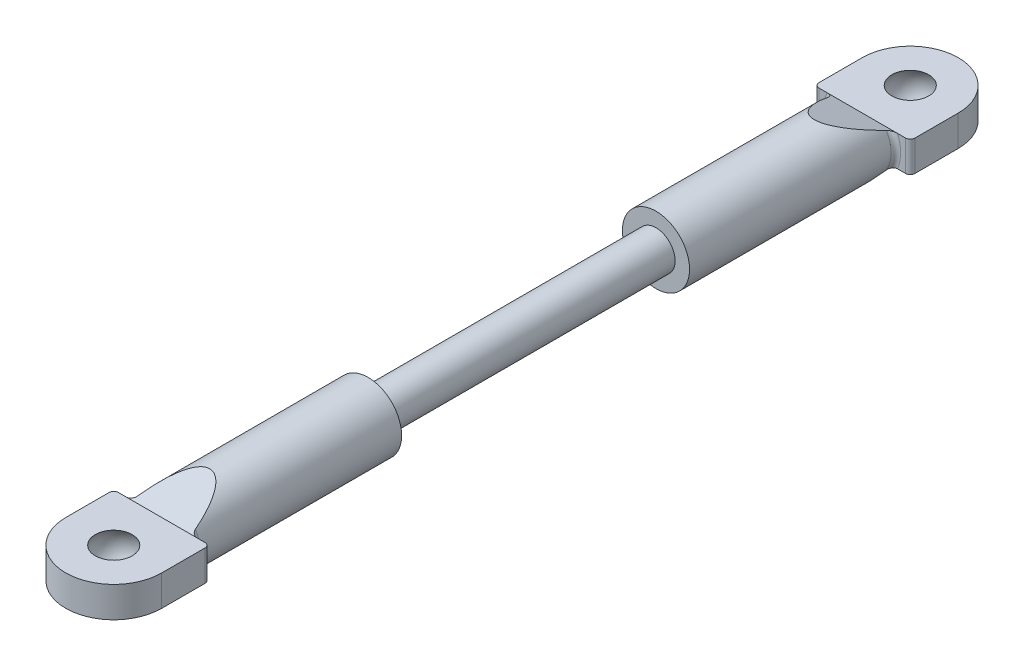
ISO-10303-21;
HEADER;
FILE_DESCRIPTION(('STEP AP214'),'2;1');
FILE_NAME('part.step','',(''),(''),'','','');
FILE_SCHEMA(('AUTOMOTIVE_DESIGN { 1 0 10303 214 1 1 1 1 }'));
ENDSEC;
DATA;
#1=APPLICATION_CONTEXT('core data for automotive mechanical design processes');
#2=APPLICATION_PROTOCOL_DEFINITION('international standard','automotive_design',2000,#1);
#3=PRODUCT_CONTEXT('',#1,'mechanical');
#4=PRODUCT('Part','Part','',(#3));
#5=PRODUCT_RELATED_PRODUCT_CATEGORY('part','',(#4));
#6=PRODUCT_DEFINITION_FORMATION('','',#4);
#7=PRODUCT_DEFINITION_CONTEXT('part definition',#1,'design');
#8=PRODUCT_DEFINITION('design','',#6,#7);
#9=PRODUCT_DEFINITION_SHAPE('','',#8);
#10=(LENGTH_UNIT() NAMED_UNIT(*) SI_UNIT(.MILLI.,.METRE.));
#11=(NAMED_UNIT(*) PLANE_ANGLE_UNIT() SI_UNIT($,.RADIAN.));
#12=(NAMED_UNIT(*) SI_UNIT($,.STERADIAN.) SOLID_ANGLE_UNIT());
#13=UNCERTAINTY_MEASURE_WITH_UNIT(LENGTH_MEASURE(1.E-05),#10,'distance_accuracy_value','');
#14=(GEOMETRIC_REPRESENTATION_CONTEXT(3) GLOBAL_UNCERTAINTY_ASSIGNED_CONTEXT((#13)) GLOBAL_UNIT_ASSIGNED_CONTEXT((#10,
#11,#12)) REPRESENTATION_CONTEXT('',''));
#15=CARTESIAN_POINT('',(0.,0.,0.));
#16=DIRECTION('',(0.,0.,1.));
#17=DIRECTION('',(1.,0.,0.));
#18=AXIS2_PLACEMENT_3D('',#15,#16,#17);
#19=CARTESIAN_POINT('',(0.,0.,-36.5));
#20=DIRECTION('',(0.,0.,1.));
#21=DIRECTION('',(1.,0.,0.));
#22=AXIS2_PLACEMENT_3D('',#19,#20,#21);
#23=CYLINDRICAL_SURFACE('',#22,3.5);
#24=CARTESIAN_POINT('',(0.,0.,-15.));
#25=DIRECTION('',(0.,0.,1.));
#26=DIRECTION('',(1.,0.,0.));
#27=AXIS2_PLACEMENT_3D('',#24,#25,#26);
#28=CIRCLE('',#27,3.5);
#29=CARTESIAN_POINT('',(3.5,0.,-15.));
#30=VERTEX_POINT('',#29);
#31=EDGE_CURVE('E186',#30,#30,#28,.T.);
#32=ORIENTED_EDGE('',*,*,#31,.F.);
#33=EDGE_LOOP('',(#32));
#34=FACE_BOUND('',#33,.T.);
#35=CARTESIAN_POINT('',(0.,0.,-40.7105263157895));
#36=DIRECTION('',(0.,0.934783580588349,-0.355217760623573));
#37=DIRECTION('',(0.,0.355217760623573,0.934783580588349));
#38=AXIS2_PLACEMENT_3D('',#35,#36,#37);
#39=ELLIPSE('',#38,9.8531109307594,3.5);
#40=CARTESIAN_POINT('',(3.00764027104307,1.79,-36.));
#41=VERTEX_POINT('',#40);
#42=CARTESIAN_POINT('',(-3.00764027104307,1.79,-36.));
#43=VERTEX_POINT('',#42);
#44=EDGE_CURVE('E513',#41,#43,#39,.F.);
#45=ORIENTED_EDGE('',*,*,#44,.T.);
#46=CARTESIAN_POINT('',(0.,0.,-36.));
#47=DIRECTION('',(0.,0.,1.));
#48=DIRECTION('',(1.,0.,0.));
#49=AXIS2_PLACEMENT_3D('',#46,#47,#48);
#50=CIRCLE('',#49,3.5);
#51=CARTESIAN_POINT('',(-3.00764027104307,-1.79,-36.));
#52=VERTEX_POINT('',#51);
#53=EDGE_CURVE('E367',#43,#52,#50,.T.);
#54=ORIENTED_EDGE('',*,*,#53,.T.);
#55=CARTESIAN_POINT('',(0.,0.,-40.7105263157895));
#56=DIRECTION('',(0.,-0.934783580588349,-0.355217760623573));
#57=DIRECTION('',(0.,-0.355217760623573,0.934783580588349));
#58=AXIS2_PLACEMENT_3D('',#55,#56,#57);
#59=ELLIPSE('',#58,9.8531109307594,3.5);
#60=CARTESIAN_POINT('',(3.00764027104307,-1.79,-36.));
#61=VERTEX_POINT('',#60);
#62=EDGE_CURVE('E210',#52,#61,#59,.F.);
#63=ORIENTED_EDGE('',*,*,#62,.T.);
#64=CARTESIAN_POINT('',(0.,0.,-36.));
#65=DIRECTION('',(0.,0.,1.));
#66=DIRECTION('',(1.,0.,0.));
#67=AXIS2_PLACEMENT_3D('',#64,#65,#66);
#68=CIRCLE('',#67,3.5);
#69=EDGE_CURVE('E364',#61,#41,#68,.T.);
#70=ORIENTED_EDGE('',*,*,#69,.T.);
#71=EDGE_LOOP('',(#45,#54,#63,#70));
#72=FACE_BOUND('',#71,.T.);
#73=ADVANCED_FACE('F37',(#34,#72),#23,.T.);
#74=CARTESIAN_POINT('',(0.,0.,15.));
#75=DIRECTION('',(0.,0.,-1.));
#76=DIRECTION('',(-1.,0.,0.));
#77=AXIS2_PLACEMENT_3D('',#74,#75,#76);
#78=CYLINDRICAL_SURFACE('',#77,2.);
#79=CARTESIAN_POINT('',(0.,0.,15.));
#80=DIRECTION('',(0.,0.,1.));
#81=DIRECTION('',(1.,0.,0.));
#82=AXIS2_PLACEMENT_3D('',#79,#80,#81);
#83=CIRCLE('',#82,2.);
#84=CARTESIAN_POINT('',(2.,0.,15.));
#85=VERTEX_POINT('',#84);
#86=EDGE_CURVE('E269',#85,#85,#83,.T.);
#87=ORIENTED_EDGE('',*,*,#86,.F.);
#88=EDGE_LOOP('',(#87));
#89=FACE_BOUND('',#88,.T.);
#90=CARTESIAN_POINT('',(0.,0.,-15.));
#91=DIRECTION('',(0.,0.,-1.));
#92=DIRECTION('',(-1.,0.,0.));
#93=AXIS2_PLACEMENT_3D('',#90,#91,#92);
#94=CIRCLE('',#93,2.);
#95=CARTESIAN_POINT('',(-2.,0.,-15.));
#96=VERTEX_POINT('',#95);
#97=EDGE_CURVE('E221',#96,#96,#94,.T.);
#98=ORIENTED_EDGE('',*,*,#97,.F.);
#99=EDGE_LOOP('',(#98));
#100=FACE_BOUND('',#99,.T.);
#101=ADVANCED_FACE('F425',(#89,#100),#78,.T.);
#102=CARTESIAN_POINT('',(0.,0.,36.5));
#103=DIRECTION('',(0.,0.,-1.));
#104=DIRECTION('',(-1.,0.,0.));
#105=AXIS2_PLACEMENT_3D('',#102,#103,#104);
#106=CYLINDRICAL_SURFACE('',#105,3.5);
#107=CARTESIAN_POINT('',(0.,0.,40.7105263157895));
#108=DIRECTION('',(0.,0.934783580588349,-0.355217760623573));
#109=DIRECTION('',(0.,-0.355217760623573,-0.934783580588349));
#110=AXIS2_PLACEMENT_3D('',#107,#108,#109);
#111=ELLIPSE('',#110,9.8531109307594,3.5);
#112=CARTESIAN_POINT('',(3.00764027104307,-1.79,36.));
#113=VERTEX_POINT('',#112);
#114=CARTESIAN_POINT('',(-3.00764027104307,-1.79,36.));
#115=VERTEX_POINT('',#114);
#116=EDGE_CURVE('E233',#113,#115,#111,.T.);
#117=ORIENTED_EDGE('',*,*,#116,.T.);
#118=CARTESIAN_POINT('',(0.,0.,36.));
#119=DIRECTION('',(0.,0.,1.));
#120=DIRECTION('',(1.,0.,0.));
#121=AXIS2_PLACEMENT_3D('',#118,#119,#120);
#122=CIRCLE('',#121,3.5);
#123=CARTESIAN_POINT('',(-3.00764027104307,1.79,36.));
#124=VERTEX_POINT('',#123);
#125=EDGE_CURVE('E290',#115,#124,#122,.F.);
#126=ORIENTED_EDGE('',*,*,#125,.T.);
#127=CARTESIAN_POINT('',(0.,0.,40.7105263157895));
#128=DIRECTION('',(0.,-0.934783580588349,-0.355217760623573));
#129=DIRECTION('',(0.,0.355217760623573,-0.934783580588349));
#130=AXIS2_PLACEMENT_3D('',#127,#128,#129);
#131=ELLIPSE('',#130,9.8531109307594,3.5);
#132=CARTESIAN_POINT('',(3.00764027104307,1.79,36.));
#133=VERTEX_POINT('',#132);
#134=EDGE_CURVE('E230',#124,#133,#131,.T.);
#135=ORIENTED_EDGE('',*,*,#134,.T.);
#136=CARTESIAN_POINT('',(0.,0.,36.));
#137=DIRECTION('',(0.,0.,1.));
#138=DIRECTION('',(1.,0.,0.));
#139=AXIS2_PLACEMENT_3D('',#136,#137,#138);
#140=CIRCLE('',#139,3.5);
#141=EDGE_CURVE('E288',#133,#113,#140,.F.);
#142=ORIENTED_EDGE('',*,*,#141,.T.);
#143=EDGE_LOOP('',(#117,#126,#135,#142));
#144=FACE_BOUND('',#143,.T.);
#145=CARTESIAN_POINT('',(0.,0.,15.));
#146=DIRECTION('',(0.,0.,1.));
#147=DIRECTION('',(1.,0.,0.));
#148=AXIS2_PLACEMENT_3D('',#145,#146,#147);
#149=CIRCLE('',#148,3.5);
#150=CARTESIAN_POINT('',(3.5,0.,15.));
#151=VERTEX_POINT('',#150);
#152=EDGE_CURVE('E266',#151,#151,#149,.T.);
#153=ORIENTED_EDGE('',*,*,#152,.T.);
#154=EDGE_LOOP('',(#153));
#155=FACE_BOUND('',#154,.T.);
#156=ADVANCED_FACE('F486',(#144,#155),#106,.T.);
#157=CARTESIAN_POINT('',(0.,0.,15.));
#158=DIRECTION('',(0.,0.,1.));
#159=DIRECTION('',(1.,0.,0.));
#160=AXIS2_PLACEMENT_3D('',#157,#158,#159);
#161=PLANE('',#160);
#162=ORIENTED_EDGE('',*,*,#86,.T.);
#163=EDGE_LOOP('',(#162));
#164=FACE_BOUND('',#163,.T.);
#165=ORIENTED_EDGE('',*,*,#152,.F.);
#166=EDGE_LOOP('',(#165));
#167=FACE_BOUND('',#166,.T.);
#168=ADVANCED_FACE('F489',(#164,#167),#161,.F.);
#169=CARTESIAN_POINT('',(4.99999999999996,1.6,36.5));
#170=DIRECTION('',(0.,0.,1.));
#171=DIRECTION('',(1.,0.,0.));
#172=AXIS2_PLACEMENT_3D('',#169,#170,#171);
#173=PLANE('',#172);
#174=DIRECTION('',(-1.,0.,0.));
#175=VECTOR('',#174,1.);
#176=CARTESIAN_POINT('',(4.99999999999996,-1.6,36.5));
#177=LINE('',#176,#175);
#178=CARTESIAN_POINT('',(-3.66606055596467,-1.6,36.5));
#179=VERTEX_POINT('',#178);
#180=CARTESIAN_POINT('',(-4.50000000000004,-1.6,36.5));
#181=VERTEX_POINT('',#180);
#182=EDGE_CURVE('E253',#179,#181,#177,.T.);
#183=ORIENTED_EDGE('',*,*,#182,.T.);
#184=DIRECTION('',(0.,-1.,0.));
#185=VECTOR('',#184,1.);
#186=CARTESIAN_POINT('',(-4.50000000000004,1.6,36.5));
#187=LINE('',#186,#185);
#188=CARTESIAN_POINT('',(-4.50000000000004,1.6,36.5));
#189=VERTEX_POINT('',#188);
#190=EDGE_CURVE('E282',#181,#189,#187,.F.);
#191=ORIENTED_EDGE('',*,*,#190,.T.);
#192=DIRECTION('',(-1.,0.,0.));
#193=VECTOR('',#192,1.);
#194=CARTESIAN_POINT('',(4.99999999999996,1.6,36.5));
#195=LINE('',#194,#193);
#196=CARTESIAN_POINT('',(-3.66606055596467,1.6,36.5));
#197=VERTEX_POINT('',#196);
#198=EDGE_CURVE('E240',#197,#189,#195,.T.);
#199=ORIENTED_EDGE('',*,*,#198,.F.);
#200=CARTESIAN_POINT('',(0.,0.,36.5));
#201=DIRECTION('',(0.,0.,1.));
#202=DIRECTION('',(1.,0.,0.));
#203=AXIS2_PLACEMENT_3D('',#200,#201,#202);
#204=CIRCLE('',#203,4.);
#205=EDGE_CURVE('E279',#197,#179,#204,.T.);
#206=ORIENTED_EDGE('',*,*,#205,.T.);
#207=EDGE_LOOP('',(#183,#191,#199,#206));
#208=FACE_BOUND('',#207,.T.);
#209=ADVANCED_FACE('F454',(#208),#173,.F.);
#210=CARTESIAN_POINT('',(4.49999999999996,1.6,36.5));
#211=VERTEX_POINT('',#210);
#212=CARTESIAN_POINT('',(3.66606055596467,1.6,36.5));
#213=VERTEX_POINT('',#212);
#214=EDGE_CURVE('E242',#211,#213,#195,.T.);
#215=ORIENTED_EDGE('',*,*,#214,.F.);
#216=DIRECTION('',(0.,-1.,0.));
#217=VECTOR('',#216,1.);
#218=CARTESIAN_POINT('',(4.49999999999996,1.6,36.5));
#219=LINE('',#218,#217);
#220=CARTESIAN_POINT('',(4.49999999999996,-1.6,36.5));
#221=VERTEX_POINT('',#220);
#222=EDGE_CURVE('E295',#211,#221,#219,.T.);
#223=ORIENTED_EDGE('',*,*,#222,.T.);
#224=CARTESIAN_POINT('',(3.66606055596467,-1.6,36.5));
#225=VERTEX_POINT('',#224);
#226=EDGE_CURVE('E254',#221,#225,#177,.T.);
#227=ORIENTED_EDGE('',*,*,#226,.T.);
#228=CARTESIAN_POINT('',(0.,0.,36.5));
#229=DIRECTION('',(0.,0.,1.));
#230=DIRECTION('',(1.,0.,0.));
#231=AXIS2_PLACEMENT_3D('',#228,#229,#230);
#232=CIRCLE('',#231,4.);
#233=EDGE_CURVE('E292',#225,#213,#232,.T.);
#234=ORIENTED_EDGE('',*,*,#233,.T.);
#235=EDGE_LOOP('',(#215,#223,#227,#234));
#236=FACE_BOUND('',#235,.T.);
#237=ADVANCED_FACE('F482',(#236),#173,.F.);
#238=CARTESIAN_POINT('',(4.99999999999996,1.6,36.5));
#239=DIRECTION('',(-1.,0.,0.));
#240=DIRECTION('',(0.,0.,1.));
#241=AXIS2_PLACEMENT_3D('',#238,#239,#240);
#242=PLANE('',#241);
#243=DIRECTION('',(0.,0.,-1.));
#244=VECTOR('',#243,1.);
#245=CARTESIAN_POINT('',(4.99999999999996,-1.6,36.5));
#246=LINE('',#245,#244);
#247=CARTESIAN_POINT('',(4.99999999999996,-1.6,41.5));
#248=VERTEX_POINT('',#247);
#249=CARTESIAN_POINT('',(4.99999999999996,-1.6,37.));
#250=VERTEX_POINT('',#249);
#251=EDGE_CURVE('E236',#248,#250,#246,.T.);
#252=ORIENTED_EDGE('',*,*,#251,.T.);
#253=DIRECTION('',(0.,-1.,0.));
#254=VECTOR('',#253,1.);
#255=CARTESIAN_POINT('',(4.99999999999996,1.6,37.));
#256=LINE('',#255,#254);
#257=CARTESIAN_POINT('',(4.99999999999996,1.6,37.));
#258=VERTEX_POINT('',#257);
#259=EDGE_CURVE('E298',#250,#258,#256,.F.);
#260=ORIENTED_EDGE('',*,*,#259,.T.);
#261=DIRECTION('',(0.,0.,-1.));
#262=VECTOR('',#261,1.);
#263=CARTESIAN_POINT('',(4.99999999999996,1.6,36.5));
#264=LINE('',#263,#262);
#265=CARTESIAN_POINT('',(4.99999999999996,1.6,41.5));
#266=VERTEX_POINT('',#265);
#267=EDGE_CURVE('E237',#266,#258,#264,.T.);
#268=ORIENTED_EDGE('',*,*,#267,.F.);
#269=DIRECTION('',(0.,-1.,0.));
#270=VECTOR('',#269,1.);
#271=CARTESIAN_POINT('',(4.99999999999996,1.6,41.5));
#272=LINE('',#271,#270);
#273=EDGE_CURVE('E250',#266,#248,#272,.T.);
#274=ORIENTED_EDGE('',*,*,#273,.T.);
#275=EDGE_LOOP('',(#252,#260,#268,#274));
#276=FACE_BOUND('',#275,.T.);
#277=ADVANCED_FACE('F476',(#276),#242,.F.);
#278=CARTESIAN_POINT('',(-5.00000000000004,1.6,36.5));
#279=DIRECTION('',(1.,0.,0.));
#280=DIRECTION('',(0.,0.,-1.));
#281=AXIS2_PLACEMENT_3D('',#278,#279,#280);
#282=PLANE('',#281);
#283=DIRECTION('',(0.,0.,1.));
#284=VECTOR('',#283,1.);
#285=CARTESIAN_POINT('',(-5.00000000000004,1.6,36.5));
#286=LINE('',#285,#284);
#287=CARTESIAN_POINT('',(-5.00000000000004,1.6,37.));
#288=VERTEX_POINT('',#287);
#289=CARTESIAN_POINT('',(-5.00000000000004,1.6,41.5));
#290=VERTEX_POINT('',#289);
#291=EDGE_CURVE('E245',#288,#290,#286,.T.);
#292=ORIENTED_EDGE('',*,*,#291,.F.);
#293=DIRECTION('',(0.,-1.,0.));
#294=VECTOR('',#293,1.);
#295=CARTESIAN_POINT('',(-5.00000000000004,1.6,37.));
#296=LINE('',#295,#294);
#297=CARTESIAN_POINT('',(-5.00000000000004,-1.6,37.));
#298=VERTEX_POINT('',#297);
#299=EDGE_CURVE('E272',#288,#298,#296,.T.);
#300=ORIENTED_EDGE('',*,*,#299,.T.);
#301=DIRECTION('',(0.,0.,1.));
#302=VECTOR('',#301,1.);
#303=CARTESIAN_POINT('',(-5.00000000000004,-1.6,36.5));
#304=LINE('',#303,#302);
#305=CARTESIAN_POINT('',(-5.00000000000004,-1.6,41.5));
#306=VERTEX_POINT('',#305);
#307=EDGE_CURVE('E257',#298,#306,#304,.T.);
#308=ORIENTED_EDGE('',*,*,#307,.T.);
#309=DIRECTION('',(0.,-1.,0.));
#310=VECTOR('',#309,1.);
#311=CARTESIAN_POINT('',(-5.00000000000004,1.6,41.5));
#312=LINE('',#311,#310);
#313=EDGE_CURVE('E263',#290,#306,#312,.T.);
#314=ORIENTED_EDGE('',*,*,#313,.F.);
#315=EDGE_LOOP('',(#292,#300,#308,#314));
#316=FACE_BOUND('',#315,.T.);
#317=ADVANCED_FACE('F466',(#316),#282,.F.);
#318=CARTESIAN_POINT('',(0.,1.6,41.5));
#319=DIRECTION('',(0.,-1.,0.));
#320=DIRECTION('',(0.,0.,-1.));
#321=AXIS2_PLACEMENT_3D('',#318,#319,#320);
#322=CYLINDRICAL_SURFACE('',#321,5.);
#323=CARTESIAN_POINT('',(0.,-1.6,41.5));
#324=DIRECTION('',(0.,1.,0.));
#325=DIRECTION('',(0.,0.,1.));
#326=AXIS2_PLACEMENT_3D('',#323,#324,#325);
#327=CIRCLE('',#326,5.);
#328=EDGE_CURVE('E241',#306,#248,#327,.T.);
#329=ORIENTED_EDGE('',*,*,#328,.T.);
#330=ORIENTED_EDGE('',*,*,#273,.F.);
#331=CARTESIAN_POINT('',(0.,1.6,41.5));
#332=DIRECTION('',(0.,1.,0.));
#333=DIRECTION('',(0.,0.,1.));
#334=AXIS2_PLACEMENT_3D('',#331,#332,#333);
#335=CIRCLE('',#334,5.);
#336=EDGE_CURVE('E248',#290,#266,#335,.T.);
#337=ORIENTED_EDGE('',*,*,#336,.F.);
#338=ORIENTED_EDGE('',*,*,#313,.T.);
#339=EDGE_LOOP('',(#329,#330,#337,#338));
#340=FACE_BOUND('',#339,.T.);
#341=ADVANCED_FACE('F472',(#340),#322,.T.);
#342=CARTESIAN_POINT('',(0.,1.6,41.5));
#343=DIRECTION('',(0.,1.,0.));
#344=DIRECTION('',(0.,0.,1.));
#345=AXIS2_PLACEMENT_3D('',#342,#343,#344);
#346=PLANE('',#345);
#347=CARTESIAN_POINT('',(0.,1.6,41.5));
#348=DIRECTION('',(0.,-1.,0.));
#349=DIRECTION('',(0.,0.,-1.));
#350=AXIS2_PLACEMENT_3D('',#347,#348,#349);
#351=CIRCLE('',#350,1.92093727122986);
#352=CARTESIAN_POINT('',(0.,1.6,39.5790627287701));
#353=VERTEX_POINT('',#352);
#354=EDGE_CURVE('E227',#353,#353,#351,.T.);
#355=ORIENTED_EDGE('',*,*,#354,.T.);
#356=EDGE_LOOP('',(#355));
#357=FACE_BOUND('',#356,.T.);
#358=ORIENTED_EDGE('',*,*,#198,.T.);
#359=CARTESIAN_POINT('',(-4.50000000000004,1.6,37.));
#360=DIRECTION('',(0.,1.,0.));
#361=DIRECTION('',(0.,0.,1.));
#362=AXIS2_PLACEMENT_3D('',#359,#360,#361);
#363=CIRCLE('',#362,0.5);
#364=EDGE_CURVE('E286',#189,#288,#363,.T.);
#365=ORIENTED_EDGE('',*,*,#364,.T.);
#366=ORIENTED_EDGE('',*,*,#291,.T.);
#367=ORIENTED_EDGE('',*,*,#336,.T.);
#368=ORIENTED_EDGE('',*,*,#267,.T.);
#369=CARTESIAN_POINT('',(4.49999999999996,1.6,37.));
#370=DIRECTION('',(0.,1.,0.));
#371=DIRECTION('',(0.,0.,1.));
#372=AXIS2_PLACEMENT_3D('',#369,#370,#371);
#373=CIRCLE('',#372,0.5);
#374=EDGE_CURVE('E284',#258,#211,#373,.T.);
#375=ORIENTED_EDGE('',*,*,#374,.T.);
#376=ORIENTED_EDGE('',*,*,#214,.T.);
#377=EDGE_CURVE('E246',#213,#197,#195,.T.);
#378=ORIENTED_EDGE('',*,*,#377,.T.);
#379=EDGE_LOOP('',(#358,#365,#366,#367,#368,#375,#376,#378));
#380=FACE_BOUND('',#379,.T.);
#381=ADVANCED_FACE('F462',(#357,#380),#346,.T.);
#382=CARTESIAN_POINT('',(0.,-1.6,41.5));
#383=DIRECTION('',(0.,1.,0.));
#384=DIRECTION('',(0.,0.,1.));
#385=AXIS2_PLACEMENT_3D('',#382,#383,#384);
#386=PLANE('',#385);
#387=CARTESIAN_POINT('',(0.,-1.6,41.5));
#388=DIRECTION('',(0.,-1.,0.));
#389=DIRECTION('',(0.,0.,-1.));
#390=AXIS2_PLACEMENT_3D('',#387,#388,#389);
#391=CIRCLE('',#390,1.92093727122986);
#392=CARTESIAN_POINT('',(0.,-1.6,39.5790627287701));
#393=VERTEX_POINT('',#392);
#394=EDGE_CURVE('E224',#393,#393,#391,.T.);
#395=ORIENTED_EDGE('',*,*,#394,.F.);
#396=EDGE_LOOP('',(#395));
#397=FACE_BOUND('',#396,.T.);
#398=ORIENTED_EDGE('',*,*,#307,.F.);
#399=CARTESIAN_POINT('',(-4.50000000000004,-1.6,37.));
#400=DIRECTION('',(0.,1.,0.));
#401=DIRECTION('',(0.,0.,1.));
#402=AXIS2_PLACEMENT_3D('',#399,#400,#401);
#403=CIRCLE('',#402,0.5);
#404=EDGE_CURVE('E277',#298,#181,#403,.F.);
#405=ORIENTED_EDGE('',*,*,#404,.T.);
#406=ORIENTED_EDGE('',*,*,#182,.F.);
#407=EDGE_CURVE('E258',#225,#179,#177,.T.);
#408=ORIENTED_EDGE('',*,*,#407,.F.);
#409=ORIENTED_EDGE('',*,*,#226,.F.);
#410=CARTESIAN_POINT('',(4.49999999999996,-1.6,37.));
#411=DIRECTION('',(0.,1.,0.));
#412=DIRECTION('',(0.,0.,1.));
#413=AXIS2_PLACEMENT_3D('',#410,#411,#412);
#414=CIRCLE('',#413,0.5);
#415=EDGE_CURVE('E275',#221,#250,#414,.F.);
#416=ORIENTED_EDGE('',*,*,#415,.T.);
#417=ORIENTED_EDGE('',*,*,#251,.F.);
#418=ORIENTED_EDGE('',*,*,#328,.F.);
#419=EDGE_LOOP('',(#398,#405,#406,#408,#409,#416,#417,#418));
#420=FACE_BOUND('',#419,.T.);
#421=ADVANCED_FACE('F439',(#397,#420),#386,.F.);
#422=CARTESIAN_POINT('',(-5.00000000000004,-3.5,31.5));
#423=DIRECTION('',(0.,0.934783580588349,-0.355217760623573));
#424=DIRECTION('',(0.,0.355217760623573,0.934783580588349));
#425=AXIS2_PLACEMENT_3D('',#422,#423,#424);
#426=PLANE('',#425);
#427=ORIENTED_EDGE('',*,*,#116,.F.);
#428=CARTESIAN_POINT('',(3.00764027104306,-1.79,36.));
#429=CARTESIAN_POINT('',(3.01501660801302,-1.77766028795213,36.0324729264418));
#430=CARTESIAN_POINT('',(3.02572054444839,-1.76562370557432,36.0641481432255));
#431=CARTESIAN_POINT('',(3.05268143397384,-1.74243941655702,36.1251594301131));
#432=CARTESIAN_POINT('',(3.06890462643524,-1.73128680248826,36.1545084145046));
#433=CARTESIAN_POINT('',(3.10582578109096,-1.71005107968239,36.2103918955726));
#434=CARTESIAN_POINT('',(3.12650175541776,-1.69996306618932,36.2369392995018));
#435=CARTESIAN_POINT('',(3.17173377932212,-1.68091062474513,36.2870773033023));
#436=CARTESIAN_POINT('',(3.19630000983909,-1.67194925885705,36.310659845113));
#437=CARTESIAN_POINT('',(3.25308702665304,-1.65394324157303,36.3580441011236));
#438=CARTESIAN_POINT('',(3.28590126291053,-1.64513316555967,36.3812285116851));
#439=CARTESIAN_POINT('',(3.35512262024705,-1.62958502321958,36.4221446757379));
#440=CARTESIAN_POINT('',(3.39152193222907,-1.62284257946172,36.4398879487849));
#441=CARTESIAN_POINT('',(3.46667654312686,-1.61181855552478,36.4688985380927));
#442=CARTESIAN_POINT('',(3.50539569079468,-1.60750655943475,36.4802458962243));
#443=CARTESIAN_POINT('',(3.58468972563839,-1.60158887924979,36.4958187388163));
#444=CARTESIAN_POINT('',(3.62527552224046,-1.60000196579963,36.4999948268431));
#445=CARTESIAN_POINT('',(3.66606055596467,-1.6,36.5));
#446=B_SPLINE_CURVE_WITH_KNOTS('',3,(#428,#429,#430,#431,#432,#433,#434,#435,#436,#437,#438,
#439,#440,#441,#442,#443,#444,#445),.UNSPECIFIED.,.F.,.F.,(4,2,2,2,2,2,2,2,4),(0.,
0.106167992198203,0.211697907824556,0.316718199165368,0.422018018143713,0.544850735918059,
0.667421577236032,0.788422358006247,0.910253310178007),.UNSPECIFIED.);
#447=EDGE_CURVE('E343',#113,#225,#446,.T.);
#448=ORIENTED_EDGE('',*,*,#447,.T.);
#449=ORIENTED_EDGE('',*,*,#407,.T.);
#450=CARTESIAN_POINT('',(-3.66606055596467,-1.6,36.5));
#451=CARTESIAN_POINT('',(-3.63078063888977,-1.60000001056058,36.499999972209));
#452=CARTESIAN_POINT('',(-3.5956179181408,-1.60118986581098,36.4968687741816));
#453=CARTESIAN_POINT('',(-3.52655388189509,-1.60567025143002,36.4850782857105));
#454=CARTESIAN_POINT('',(-3.49264665949915,-1.60894911259673,36.4764497036928));
#455=CARTESIAN_POINT('',(-3.42683574135487,-1.61731864154893,36.4544246275028));
#456=CARTESIAN_POINT('',(-3.39492497711937,-1.62240243525609,36.4410462230103));
#457=CARTESIAN_POINT('',(-3.33346675755787,-1.63416518792784,36.4100916107162));
#458=CARTESIAN_POINT('',(-3.30392365430699,-1.64084699836385,36.3925078990425));
#459=CARTESIAN_POINT('',(-3.24361803739982,-1.65669629654687,36.3507992196135));
#460=CARTESIAN_POINT('',(-3.2133145497666,-1.66608478340738,36.3260926752437));
#461=CARTESIAN_POINT('',(-3.15729695298565,-1.68646854640408,36.2724511936735));
#462=CARTESIAN_POINT('',(-3.13158499781672,-1.69746457229265,36.2435142834404));
#463=CARTESIAN_POINT('',(-3.08849280363673,-1.71942769351274,36.1857165960191));
#464=CARTESIAN_POINT('',(-3.07048210952563,-1.73023882163715,36.1572662588496));
#465=CARTESIAN_POINT('',(-3.03967295120166,-1.7527379284266,36.0980580830879));
#466=CARTESIAN_POINT('',(-3.026855560671,-1.7644225359027,36.0673091160455));
#467=CARTESIAN_POINT('',(-3.01354455450079,-1.78090239560611,36.0239410641945));
#468=CARTESIAN_POINT('',(-3.01035806349222,-1.78543358828867,36.0120168729246));
#469=CARTESIAN_POINT('',(-3.00764027104306,-1.79,36.));
#470=B_SPLINE_CURVE_WITH_KNOTS('',3,(#450,#451,#452,#453,#454,#455,#456,#457,#458,#459,#460,
#461,#462,#463,#464,#465,#466,#467,#468,#469),.UNSPECIFIED.,.F.,.F.,(4,2,2,2,2,2,2,2,2,4),(0.,
0.105514918398724,0.210445536564004,0.314980739690672,0.419703883801088,0.539819680998127,
0.659991679707302,0.765692662085833,0.871004889168675,0.910420537913499),.UNSPECIFIED.);
#471=EDGE_CURVE('E300',#179,#115,#470,.T.);
#472=ORIENTED_EDGE('',*,*,#471,.T.);
#473=EDGE_LOOP('',(#427,#448,#449,#472));
#474=FACE_BOUND('',#473,.T.);
#475=ADVANCED_FACE('F313',(#474),#426,.F.);
#476=CARTESIAN_POINT('',(-5.00000000000004,3.5,31.5));
#477=DIRECTION('',(0.,-0.934783580588349,-0.355217760623573));
#478=DIRECTION('',(0.,0.355217760623573,-0.934783580588349));
#479=AXIS2_PLACEMENT_3D('',#476,#477,#478);
#480=PLANE('',#479);
#481=ORIENTED_EDGE('',*,*,#134,.F.);
#482=CARTESIAN_POINT('',(-3.00764027104306,1.79,36.));
#483=CARTESIAN_POINT('',(-3.01501660801302,1.77766028795213,36.0324729264418));
#484=CARTESIAN_POINT('',(-3.02572054444839,1.76562370557432,36.0641481432255));
#485=CARTESIAN_POINT('',(-3.05268143397384,1.74243941655702,36.1251594301131));
#486=CARTESIAN_POINT('',(-3.06890462643524,1.73128680248826,36.1545084145046));
#487=CARTESIAN_POINT('',(-3.10582578109096,1.71005107968239,36.2103918955726));
#488=CARTESIAN_POINT('',(-3.12650175541776,1.69996306618932,36.2369392995018));
#489=CARTESIAN_POINT('',(-3.17173377932212,1.68091062474513,36.2870773033023));
#490=CARTESIAN_POINT('',(-3.19630000983909,1.67194925885705,36.310659845113));
#491=CARTESIAN_POINT('',(-3.25308702665304,1.65394324157303,36.3580441011236));
#492=CARTESIAN_POINT('',(-3.28590126291053,1.64513316555967,36.3812285116851));
#493=CARTESIAN_POINT('',(-3.35512262024705,1.62958502321958,36.4221446757379));
#494=CARTESIAN_POINT('',(-3.39152193222907,1.62284257946172,36.4398879487849));
#495=CARTESIAN_POINT('',(-3.46667654312686,1.61181855552478,36.4688985380927));
#496=CARTESIAN_POINT('',(-3.50539569079468,1.60750655943475,36.4802458962243));
#497=CARTESIAN_POINT('',(-3.58468972563839,1.60158887924979,36.4958187388163));
#498=CARTESIAN_POINT('',(-3.62527552224046,1.60000196579963,36.4999948268431));
#499=CARTESIAN_POINT('',(-3.66606055596467,1.6,36.5));
#500=B_SPLINE_CURVE_WITH_KNOTS('',3,(#482,#483,#484,#485,#486,#487,#488,#489,#490,#491,#492,
#493,#494,#495,#496,#497,#498,#499),.UNSPECIFIED.,.F.,.F.,(4,2,2,2,2,2,2,2,4),(0.,
0.106167992198203,0.211697907824556,0.316718199165368,0.422018018143713,0.544850735918059,
0.667421577236032,0.788422358006247,0.910253310178007),.UNSPECIFIED.);
#501=EDGE_CURVE('E307',#124,#197,#500,.T.);
#502=ORIENTED_EDGE('',*,*,#501,.T.);
#503=ORIENTED_EDGE('',*,*,#377,.F.);
#504=CARTESIAN_POINT('',(3.66606055596467,1.6,36.5));
#505=CARTESIAN_POINT('',(3.63078063888977,1.60000001056058,36.499999972209));
#506=CARTESIAN_POINT('',(3.5956179181408,1.60118986581098,36.4968687741816));
#507=CARTESIAN_POINT('',(3.52655388189509,1.60567025143002,36.4850782857105));
#508=CARTESIAN_POINT('',(3.49264665949915,1.60894911259673,36.4764497036928));
#509=CARTESIAN_POINT('',(3.42683574135487,1.61731864154893,36.4544246275028));
#510=CARTESIAN_POINT('',(3.39492497711937,1.62240243525609,36.4410462230103));
#511=CARTESIAN_POINT('',(3.33346675755787,1.63416518792784,36.4100916107162));
#512=CARTESIAN_POINT('',(3.30392365430699,1.64084699836385,36.3925078990425));
#513=CARTESIAN_POINT('',(3.24361803739982,1.65669629654687,36.3507992196135));
#514=CARTESIAN_POINT('',(3.2133145497666,1.66608478340738,36.3260926752437));
#515=CARTESIAN_POINT('',(3.15729695298565,1.68646854640408,36.2724511936735));
#516=CARTESIAN_POINT('',(3.13158499781672,1.69746457229265,36.2435142834404));
#517=CARTESIAN_POINT('',(3.08849280363673,1.71942769351274,36.1857165960191));
#518=CARTESIAN_POINT('',(3.07048210952563,1.73023882163715,36.1572662588496));
#519=CARTESIAN_POINT('',(3.03967295120166,1.7527379284266,36.0980580830879));
#520=CARTESIAN_POINT('',(3.026855560671,1.7644225359027,36.0673091160455));
#521=CARTESIAN_POINT('',(3.01354455450079,1.78090239560611,36.0239410641945));
#522=CARTESIAN_POINT('',(3.01035806349222,1.78543358828867,36.0120168729246));
#523=CARTESIAN_POINT('',(3.00764027104306,1.79,36.));
#524=B_SPLINE_CURVE_WITH_KNOTS('',3,(#504,#505,#506,#507,#508,#509,#510,#511,#512,#513,#514,
#515,#516,#517,#518,#519,#520,#521,#522,#523),.UNSPECIFIED.,.F.,.F.,(4,2,2,2,2,2,2,2,2,4),(0.,
0.105514918398723,0.210445536564004,0.314980739690672,0.419703883801088,0.539819680998126,
0.659991679707302,0.765692662085833,0.871004889168675,0.910420537913499),.UNSPECIFIED.);
#525=EDGE_CURVE('E338',#213,#133,#524,.T.);
#526=ORIENTED_EDGE('',*,*,#525,.T.);
#527=EDGE_LOOP('',(#481,#502,#503,#526));
#528=FACE_BOUND('',#527,.T.);
#529=ADVANCED_FACE('F429',(#528),#480,.F.);
#530=CARTESIAN_POINT('',(-4.50000000000004,1.6,37.));
#531=DIRECTION('',(0.,-1.,0.));
#532=DIRECTION('',(0.,0.,-1.));
#533=AXIS2_PLACEMENT_3D('',#530,#531,#532);
#534=CYLINDRICAL_SURFACE('',#533,0.5);
#535=ORIENTED_EDGE('',*,*,#364,.F.);
#536=ORIENTED_EDGE('',*,*,#190,.F.);
#537=ORIENTED_EDGE('',*,*,#404,.F.);
#538=ORIENTED_EDGE('',*,*,#299,.F.);
#539=EDGE_LOOP('',(#535,#536,#537,#538));
#540=FACE_BOUND('',#539,.T.);
#541=ADVANCED_FACE('F322',(#540),#534,.T.);
#542=CARTESIAN_POINT('',(0.,0.,36.));
#543=DIRECTION('',(0.,0.,1.));
#544=DIRECTION('',(1.,0.,0.));
#545=AXIS2_PLACEMENT_3D('',#542,#543,#544);
#546=TOROIDAL_SURFACE('',#545,4.,0.5);
#547=ORIENTED_EDGE('',*,*,#501,.F.);
#548=ORIENTED_EDGE('',*,*,#125,.F.);
#549=ORIENTED_EDGE('',*,*,#471,.F.);
#550=ORIENTED_EDGE('',*,*,#205,.F.);
#551=EDGE_LOOP('',(#547,#548,#549,#550));
#552=FACE_BOUND('',#551,.T.);
#553=ADVANCED_FACE('F316',(#552),#546,.F.);
#554=CARTESIAN_POINT('',(4.49999999999996,1.6,37.));
#555=DIRECTION('',(0.,-1.,0.));
#556=DIRECTION('',(0.,0.,-1.));
#557=AXIS2_PLACEMENT_3D('',#554,#555,#556);
#558=CYLINDRICAL_SURFACE('',#557,0.5);
#559=ORIENTED_EDGE('',*,*,#374,.F.);
#560=ORIENTED_EDGE('',*,*,#259,.F.);
#561=ORIENTED_EDGE('',*,*,#415,.F.);
#562=ORIENTED_EDGE('',*,*,#222,.F.);
#563=EDGE_LOOP('',(#559,#560,#561,#562));
#564=FACE_BOUND('',#563,.T.);
#565=ADVANCED_FACE('F321',(#564),#558,.T.);
#566=CARTESIAN_POINT('',(0.,0.,36.));
#567=DIRECTION('',(0.,0.,1.));
#568=DIRECTION('',(1.,0.,0.));
#569=AXIS2_PLACEMENT_3D('',#566,#567,#568);
#570=TOROIDAL_SURFACE('',#569,4.,0.5);
#571=ORIENTED_EDGE('',*,*,#447,.F.);
#572=ORIENTED_EDGE('',*,*,#141,.F.);
#573=ORIENTED_EDGE('',*,*,#525,.F.);
#574=ORIENTED_EDGE('',*,*,#233,.F.);
#575=EDGE_LOOP('',(#571,#572,#573,#574));
#576=FACE_BOUND('',#575,.T.);
#577=ADVANCED_FACE('F328',(#576),#570,.F.);
#578=CARTESIAN_POINT('',(0.,0.,41.5));
#579=DIRECTION('',(0.,-1.,0.));
#580=DIRECTION('',(0.,0.,1.));
#581=AXIS2_PLACEMENT_3D('',#578,#579,#580);
#582=SPHERICAL_SURFACE('',#581,2.5);
#583=ORIENTED_EDGE('',*,*,#394,.T.);
#584=EDGE_LOOP('',(#583));
#585=FACE_BOUND('',#584,.T.);
#586=ORIENTED_EDGE('',*,*,#354,.F.);
#587=EDGE_LOOP('',(#586));
#588=FACE_BOUND('',#587,.T.);
#589=ADVANCED_FACE('F333',(#585,#588),#582,.F.);
#590=CARTESIAN_POINT('',(0.,0.,-15.));
#591=DIRECTION('',(0.,0.,-1.));
#592=DIRECTION('',(1.,0.,0.));
#593=AXIS2_PLACEMENT_3D('',#590,#591,#592);
#594=PLANE('',#593);
#595=ORIENTED_EDGE('',*,*,#97,.T.);
#596=EDGE_LOOP('',(#595));
#597=FACE_BOUND('',#596,.T.);
#598=ORIENTED_EDGE('',*,*,#31,.T.);
#599=EDGE_LOOP('',(#598));
#600=FACE_BOUND('',#599,.T.);
#601=ADVANCED_FACE('F411',(#597,#600),#594,.F.);
#602=CARTESIAN_POINT('',(4.99999999999996,1.6,-36.5));
#603=DIRECTION('',(0.,0.,1.));
#604=DIRECTION('',(1.,0.,0.));
#605=AXIS2_PLACEMENT_3D('',#602,#603,#604);
#606=PLANE('',#605);
#607=DIRECTION('',(-1.,0.,0.));
#608=VECTOR('',#607,1.);
#609=CARTESIAN_POINT('',(4.99999999999996,1.6,-36.5));
#610=LINE('',#609,#608);
#611=CARTESIAN_POINT('',(-3.66606055596467,1.6,-36.5));
#612=VERTEX_POINT('',#611);
#613=CARTESIAN_POINT('',(-4.50000000000004,1.6,-36.5));
#614=VERTEX_POINT('',#613);
#615=EDGE_CURVE('E202',#612,#614,#610,.T.);
#616=ORIENTED_EDGE('',*,*,#615,.T.);
#617=DIRECTION('',(0.,-1.,0.));
#618=VECTOR('',#617,1.);
#619=CARTESIAN_POINT('',(-4.50000000000004,1.6,-36.5));
#620=LINE('',#619,#618);
#621=CARTESIAN_POINT('',(-4.50000000000004,-1.6,-36.5));
#622=VERTEX_POINT('',#621);
#623=EDGE_CURVE('E352',#614,#622,#620,.T.);
#624=ORIENTED_EDGE('',*,*,#623,.T.);
#625=DIRECTION('',(-1.,0.,0.));
#626=VECTOR('',#625,1.);
#627=CARTESIAN_POINT('',(4.99999999999996,-1.6,-36.5));
#628=LINE('',#627,#626);
#629=CARTESIAN_POINT('',(-3.66606055596467,-1.6,-36.5));
#630=VERTEX_POINT('',#629);
#631=EDGE_CURVE('E214',#630,#622,#628,.T.);
#632=ORIENTED_EDGE('',*,*,#631,.F.);
#633=CARTESIAN_POINT('',(0.,0.,-36.5));
#634=DIRECTION('',(0.,0.,1.));
#635=DIRECTION('',(1.,0.,0.));
#636=AXIS2_PLACEMENT_3D('',#633,#634,#635);
#637=CIRCLE('',#636,4.);
#638=EDGE_CURVE('E349',#630,#612,#637,.F.);
#639=ORIENTED_EDGE('',*,*,#638,.T.);
#640=EDGE_LOOP('',(#616,#624,#632,#639));
#641=FACE_BOUND('',#640,.T.);
#642=ADVANCED_FACE('F407',(#641),#606,.T.);
#643=CARTESIAN_POINT('',(4.49999999999996,-1.6,-36.5));
#644=VERTEX_POINT('',#643);
#645=CARTESIAN_POINT('',(3.66606055596467,-1.6,-36.5));
#646=VERTEX_POINT('',#645);
#647=EDGE_CURVE('E195',#644,#646,#628,.T.);
#648=ORIENTED_EDGE('',*,*,#647,.F.);
#649=DIRECTION('',(0.,-1.,0.));
#650=VECTOR('',#649,1.);
#651=CARTESIAN_POINT('',(4.49999999999996,1.6,-36.5));
#652=LINE('',#651,#650);
#653=CARTESIAN_POINT('',(4.49999999999996,1.6,-36.5));
#654=VERTEX_POINT('',#653);
#655=EDGE_CURVE('E375',#644,#654,#652,.F.);
#656=ORIENTED_EDGE('',*,*,#655,.T.);
#657=CARTESIAN_POINT('',(3.66606055596467,1.6,-36.5));
#658=VERTEX_POINT('',#657);
#659=EDGE_CURVE('E206',#654,#658,#610,.T.);
#660=ORIENTED_EDGE('',*,*,#659,.T.);
#661=CARTESIAN_POINT('',(0.,0.,-36.5));
#662=DIRECTION('',(0.,0.,1.));
#663=DIRECTION('',(1.,0.,0.));
#664=AXIS2_PLACEMENT_3D('',#661,#662,#663);
#665=CIRCLE('',#664,4.);
#666=EDGE_CURVE('E372',#658,#646,#665,.F.);
#667=ORIENTED_EDGE('',*,*,#666,.T.);
#668=EDGE_LOOP('',(#648,#656,#660,#667));
#669=FACE_BOUND('',#668,.T.);
#670=ADVANCED_FACE('F410',(#669),#606,.T.);
#671=CARTESIAN_POINT('',(4.99999999999996,1.6,-36.5));
#672=DIRECTION('',(1.,0.,0.));
#673=DIRECTION('',(0.,0.,-1.));
#674=AXIS2_PLACEMENT_3D('',#671,#672,#673);
#675=PLANE('',#674);
#676=DIRECTION('',(0.,0.,1.));
#677=VECTOR('',#676,1.);
#678=CARTESIAN_POINT('',(4.99999999999996,1.6,-36.5));
#679=LINE('',#678,#677);
#680=CARTESIAN_POINT('',(4.99999999999996,1.6,-41.5));
#681=VERTEX_POINT('',#680);
#682=CARTESIAN_POINT('',(4.99999999999996,1.6,-37.));
#683=VERTEX_POINT('',#682);
#684=EDGE_CURVE('E178',#681,#683,#679,.T.);
#685=ORIENTED_EDGE('',*,*,#684,.T.);
#686=DIRECTION('',(0.,-1.,0.));
#687=VECTOR('',#686,1.);
#688=CARTESIAN_POINT('',(4.99999999999996,1.6,-37.));
#689=LINE('',#688,#687);
#690=CARTESIAN_POINT('',(4.99999999999996,-1.6,-37.));
#691=VERTEX_POINT('',#690);
#692=EDGE_CURVE('E370',#683,#691,#689,.T.);
#693=ORIENTED_EDGE('',*,*,#692,.T.);
#694=DIRECTION('',(0.,0.,1.));
#695=VECTOR('',#694,1.);
#696=CARTESIAN_POINT('',(4.99999999999996,-1.6,-36.5));
#697=LINE('',#696,#695);
#698=CARTESIAN_POINT('',(4.99999999999996,-1.6,-41.5));
#699=VERTEX_POINT('',#698);
#700=EDGE_CURVE('E181',#699,#691,#697,.T.);
#701=ORIENTED_EDGE('',*,*,#700,.F.);
#702=DIRECTION('',(0.,-1.,0.));
#703=VECTOR('',#702,1.);
#704=CARTESIAN_POINT('',(4.99999999999996,1.6,-41.5));
#705=LINE('',#704,#703);
#706=EDGE_CURVE('E174',#681,#699,#705,.T.);
#707=ORIENTED_EDGE('',*,*,#706,.F.);
#708=EDGE_LOOP('',(#685,#693,#701,#707));
#709=FACE_BOUND('',#708,.T.);
#710=ADVANCED_FACE('F176',(#709),#675,.T.);
#711=CARTESIAN_POINT('',(0.,1.6,-41.5));
#712=DIRECTION('',(0.,-1.,0.));
#713=DIRECTION('',(0.,0.,-1.));
#714=AXIS2_PLACEMENT_3D('',#711,#712,#713);
#715=CYLINDRICAL_SURFACE('',#714,5.);
#716=CARTESIAN_POINT('',(0.,-1.6,-41.5));
#717=DIRECTION('',(0.,-1.,0.));
#718=DIRECTION('',(0.,0.,-1.));
#719=AXIS2_PLACEMENT_3D('',#716,#717,#718);
#720=CIRCLE('',#719,5.);
#721=CARTESIAN_POINT('',(-5.00000000000004,-1.6,-41.5));
#722=VERTEX_POINT('',#721);
#723=EDGE_CURVE('E209',#722,#699,#720,.T.);
#724=ORIENTED_EDGE('',*,*,#723,.F.);
#725=DIRECTION('',(0.,-1.,0.));
#726=VECTOR('',#725,1.);
#727=CARTESIAN_POINT('',(-5.00000000000004,1.6,-41.5));
#728=LINE('',#727,#726);
#729=CARTESIAN_POINT('',(-5.00000000000004,1.6,-41.5));
#730=VERTEX_POINT('',#729);
#731=EDGE_CURVE('E187',#730,#722,#728,.T.);
#732=ORIENTED_EDGE('',*,*,#731,.F.);
#733=CARTESIAN_POINT('',(0.,1.6,-41.5));
#734=DIRECTION('',(0.,-1.,0.));
#735=DIRECTION('',(0.,0.,-1.));
#736=AXIS2_PLACEMENT_3D('',#733,#734,#735);
#737=CIRCLE('',#736,5.);
#738=EDGE_CURVE('E192',#730,#681,#737,.T.);
#739=ORIENTED_EDGE('',*,*,#738,.T.);
#740=ORIENTED_EDGE('',*,*,#706,.T.);
#741=EDGE_LOOP('',(#724,#732,#739,#740));
#742=FACE_BOUND('',#741,.T.);
#743=ADVANCED_FACE('F198',(#742),#715,.T.);
#744=CARTESIAN_POINT('',(-5.00000000000004,1.6,-36.5));
#745=DIRECTION('',(-1.,0.,0.));
#746=DIRECTION('',(0.,0.,1.));
#747=AXIS2_PLACEMENT_3D('',#744,#745,#746);
#748=PLANE('',#747);
#749=DIRECTION('',(0.,0.,-1.));
#750=VECTOR('',#749,1.);
#751=CARTESIAN_POINT('',(-5.00000000000004,-1.6,-36.5));
#752=LINE('',#751,#750);
#753=CARTESIAN_POINT('',(-5.00000000000004,-1.6,-37.));
#754=VERTEX_POINT('',#753);
#755=EDGE_CURVE('E212',#754,#722,#752,.T.);
#756=ORIENTED_EDGE('',*,*,#755,.F.);
#757=DIRECTION('',(0.,-1.,0.));
#758=VECTOR('',#757,1.);
#759=CARTESIAN_POINT('',(-5.00000000000004,1.6,-37.));
#760=LINE('',#759,#758);
#761=CARTESIAN_POINT('',(-5.00000000000004,1.6,-37.));
#762=VERTEX_POINT('',#761);
#763=EDGE_CURVE('E359',#754,#762,#760,.F.);
#764=ORIENTED_EDGE('',*,*,#763,.T.);
#765=DIRECTION('',(0.,0.,-1.));
#766=VECTOR('',#765,1.);
#767=CARTESIAN_POINT('',(-5.00000000000004,1.6,-36.5));
#768=LINE('',#767,#766);
#769=EDGE_CURVE('E200',#762,#730,#768,.T.);
#770=ORIENTED_EDGE('',*,*,#769,.T.);
#771=ORIENTED_EDGE('',*,*,#731,.T.);
#772=EDGE_LOOP('',(#756,#764,#770,#771));
#773=FACE_BOUND('',#772,.T.);
#774=ADVANCED_FACE('F402',(#773),#748,.T.);
#775=CARTESIAN_POINT('',(0.,1.6,-41.5));
#776=DIRECTION('',(0.,1.,0.));
#777=DIRECTION('',(0.,0.,-1.));
#778=AXIS2_PLACEMENT_3D('',#775,#776,#777);
#779=PLANE('',#778);
#780=CARTESIAN_POINT('',(0.,1.6,-41.5));
#781=DIRECTION('',(0.,1.,0.));
#782=DIRECTION('',(0.,0.,1.));
#783=AXIS2_PLACEMENT_3D('',#780,#781,#782);
#784=CIRCLE('',#783,1.92093727122986);
#785=CARTESIAN_POINT('',(0.,1.6,-39.5790627287701));
#786=VERTEX_POINT('',#785);
#787=EDGE_CURVE('E520',#786,#786,#784,.T.);
#788=ORIENTED_EDGE('',*,*,#787,.F.);
#789=EDGE_LOOP('',(#788));
#790=FACE_BOUND('',#789,.T.);
#791=ORIENTED_EDGE('',*,*,#769,.F.);
#792=CARTESIAN_POINT('',(-4.50000000000004,1.6,-37.));
#793=DIRECTION('',(0.,1.,0.));
#794=DIRECTION('',(0.,0.,1.));
#795=AXIS2_PLACEMENT_3D('',#792,#793,#794);
#796=CIRCLE('',#795,0.5);
#797=EDGE_CURVE('E362',#762,#614,#796,.T.);
#798=ORIENTED_EDGE('',*,*,#797,.T.);
#799=ORIENTED_EDGE('',*,*,#615,.F.);
#800=EDGE_CURVE('E58',#658,#612,#610,.T.);
#801=ORIENTED_EDGE('',*,*,#800,.F.);
#802=ORIENTED_EDGE('',*,*,#659,.F.);
#803=CARTESIAN_POINT('',(4.49999999999996,1.6,-37.));
#804=DIRECTION('',(0.,1.,0.));
#805=DIRECTION('',(0.,0.,1.));
#806=AXIS2_PLACEMENT_3D('',#803,#804,#805);
#807=CIRCLE('',#806,0.5);
#808=EDGE_CURVE('E194',#654,#683,#807,.T.);
#809=ORIENTED_EDGE('',*,*,#808,.T.);
#810=ORIENTED_EDGE('',*,*,#684,.F.);
#811=ORIENTED_EDGE('',*,*,#738,.F.);
#812=EDGE_LOOP('',(#791,#798,#799,#801,#802,#809,#810,#811));
#813=FACE_BOUND('',#812,.T.);
#814=ADVANCED_FACE('F191',(#790,#813),#779,.T.);
#815=CARTESIAN_POINT('',(0.,-1.6,-41.5));
#816=DIRECTION('',(0.,1.,0.));
#817=DIRECTION('',(0.,0.,-1.));
#818=AXIS2_PLACEMENT_3D('',#815,#816,#817);
#819=PLANE('',#818);
#820=CARTESIAN_POINT('',(0.,-1.6,-41.5));
#821=DIRECTION('',(0.,1.,0.));
#822=DIRECTION('',(0.,0.,1.));
#823=AXIS2_PLACEMENT_3D('',#820,#821,#822);
#824=CIRCLE('',#823,1.92093727122986);
#825=CARTESIAN_POINT('',(0.,-1.6,-39.5790627287701));
#826=VERTEX_POINT('',#825);
#827=EDGE_CURVE('E530',#826,#826,#824,.T.);
#828=ORIENTED_EDGE('',*,*,#827,.T.);
#829=EDGE_LOOP('',(#828));
#830=FACE_BOUND('',#829,.T.);
#831=ORIENTED_EDGE('',*,*,#631,.T.);
#832=CARTESIAN_POINT('',(-4.50000000000004,-1.6,-37.));
#833=DIRECTION('',(0.,1.,0.));
#834=DIRECTION('',(0.,0.,1.));
#835=AXIS2_PLACEMENT_3D('',#832,#833,#834);
#836=CIRCLE('',#835,0.5);
#837=EDGE_CURVE('E357',#622,#754,#836,.F.);
#838=ORIENTED_EDGE('',*,*,#837,.T.);
#839=ORIENTED_EDGE('',*,*,#755,.T.);
#840=ORIENTED_EDGE('',*,*,#723,.T.);
#841=ORIENTED_EDGE('',*,*,#700,.T.);
#842=CARTESIAN_POINT('',(4.49999999999996,-1.6,-37.));
#843=DIRECTION('',(0.,1.,0.));
#844=DIRECTION('',(0.,0.,1.));
#845=AXIS2_PLACEMENT_3D('',#842,#843,#844);
#846=CIRCLE('',#845,0.5);
#847=EDGE_CURVE('E355',#691,#644,#846,.F.);
#848=ORIENTED_EDGE('',*,*,#847,.T.);
#849=ORIENTED_EDGE('',*,*,#647,.T.);
#850=EDGE_CURVE('E217',#646,#630,#628,.T.);
#851=ORIENTED_EDGE('',*,*,#850,.T.);
#852=EDGE_LOOP('',(#831,#838,#839,#840,#841,#848,#849,#851));
#853=FACE_BOUND('',#852,.T.);
#854=ADVANCED_FACE('F395',(#830,#853),#819,.F.);
#855=CARTESIAN_POINT('',(-5.00000000000004,-3.5,-31.5));
#856=DIRECTION('',(0.,-0.934783580588349,-0.355217760623573));
#857=DIRECTION('',(0.,0.355217760623573,-0.934783580588349));
#858=AXIS2_PLACEMENT_3D('',#855,#856,#857);
#859=PLANE('',#858);
#860=ORIENTED_EDGE('',*,*,#62,.F.);
#861=CARTESIAN_POINT('',(-3.00764027104306,-1.79,-36.));
#862=CARTESIAN_POINT('',(-3.01501660801302,-1.77766028795213,-36.0324729264418));
#863=CARTESIAN_POINT('',(-3.02572054444839,-1.76562370557432,-36.0641481432255));
#864=CARTESIAN_POINT('',(-3.05268143397384,-1.74243941655702,-36.1251594301131));
#865=CARTESIAN_POINT('',(-3.06890462643524,-1.73128680248826,-36.1545084145046));
#866=CARTESIAN_POINT('',(-3.10582578109096,-1.71005107968239,-36.2103918955726));
#867=CARTESIAN_POINT('',(-3.12650175541776,-1.69996306618932,-36.2369392995018));
#868=CARTESIAN_POINT('',(-3.17173377932212,-1.68091062474513,-36.2870773033023));
#869=CARTESIAN_POINT('',(-3.19630000983909,-1.67194925885705,-36.310659845113));
#870=CARTESIAN_POINT('',(-3.25308702665304,-1.65394324157303,-36.3580441011236));
#871=CARTESIAN_POINT('',(-3.28590126291053,-1.64513316555967,-36.3812285116851));
#872=CARTESIAN_POINT('',(-3.35512262024705,-1.62958502321958,-36.4221446757379));
#873=CARTESIAN_POINT('',(-3.39152193222907,-1.62284257946172,-36.4398879487849));
#874=CARTESIAN_POINT('',(-3.46667654312686,-1.61181855552478,-36.4688985380927));
#875=CARTESIAN_POINT('',(-3.50539569079468,-1.60750655943475,-36.4802458962243));
#876=CARTESIAN_POINT('',(-3.58468972563839,-1.60158887924979,-36.4958187388163));
#877=CARTESIAN_POINT('',(-3.62527552224046,-1.60000196579963,-36.4999948268431));
#878=CARTESIAN_POINT('',(-3.66606055596467,-1.6,-36.5));
#879=B_SPLINE_CURVE_WITH_KNOTS('',3,(#861,#862,#863,#864,#865,#866,#867,#868,#869,#870,#871,
#872,#873,#874,#875,#876,#877,#878),.UNSPECIFIED.,.F.,.F.,(4,2,2,2,2,2,2,2,4),(0.,
0.106167992198203,0.211697907824556,0.316718199165368,0.422018018143713,0.544850735918059,
0.667421577236032,0.788422358006247,0.910253310178007),.UNSPECIFIED.);
#880=EDGE_CURVE('E377',#52,#630,#879,.T.);
#881=ORIENTED_EDGE('',*,*,#880,.T.);
#882=ORIENTED_EDGE('',*,*,#850,.F.);
#883=CARTESIAN_POINT('',(3.66606055596467,-1.6,-36.5));
#884=CARTESIAN_POINT('',(3.63078063888977,-1.60000001056058,-36.499999972209));
#885=CARTESIAN_POINT('',(3.5956179181408,-1.60118986581098,-36.4968687741816));
#886=CARTESIAN_POINT('',(3.52655388189509,-1.60567025143002,-36.4850782857105));
#887=CARTESIAN_POINT('',(3.49264665949915,-1.60894911259673,-36.4764497036928));
#888=CARTESIAN_POINT('',(3.42683574135487,-1.61731864154893,-36.4544246275028));
#889=CARTESIAN_POINT('',(3.39492497711937,-1.62240243525609,-36.4410462230103));
#890=CARTESIAN_POINT('',(3.33346675755787,-1.63416518792784,-36.4100916107162));
#891=CARTESIAN_POINT('',(3.30392365430699,-1.64084699836385,-36.3925078990425));
#892=CARTESIAN_POINT('',(3.24361803739982,-1.65669629654687,-36.3507992196135));
#893=CARTESIAN_POINT('',(3.2133145497666,-1.66608478340738,-36.3260926752437));
#894=CARTESIAN_POINT('',(3.15729695298565,-1.68646854640408,-36.2724511936735));
#895=CARTESIAN_POINT('',(3.13158499781672,-1.69746457229265,-36.2435142834404));
#896=CARTESIAN_POINT('',(3.08849280363673,-1.71942769351274,-36.1857165960191));
#897=CARTESIAN_POINT('',(3.07048210952563,-1.73023882163715,-36.1572662588496));
#898=CARTESIAN_POINT('',(3.03967295120166,-1.7527379284266,-36.0980580830879));
#899=CARTESIAN_POINT('',(3.026855560671,-1.7644225359027,-36.0673091160455));
#900=CARTESIAN_POINT('',(3.01354455450079,-1.78090239560611,-36.0239410641945));
#901=CARTESIAN_POINT('',(3.01035806349222,-1.78543358828867,-36.0120168729246));
#902=CARTESIAN_POINT('',(3.00764027104306,-1.79,-36.));
#903=B_SPLINE_CURVE_WITH_KNOTS('',3,(#883,#884,#885,#886,#887,#888,#889,#890,#891,#892,#893,
#894,#895,#896,#897,#898,#899,#900,#901,#902),.UNSPECIFIED.,.F.,.F.,(4,2,2,2,2,2,2,2,2,4),(0.,
0.105514918398723,0.210445536564004,0.314980739690672,0.419703883801088,0.539819680998126,
0.659991679707302,0.765692662085833,0.871004889168675,0.910420537913499),.UNSPECIFIED.);
#904=EDGE_CURVE('E11',#646,#61,#903,.T.);
#905=ORIENTED_EDGE('',*,*,#904,.T.);
#906=EDGE_LOOP('',(#860,#881,#882,#905));
#907=FACE_BOUND('',#906,.T.);
#908=ADVANCED_FACE('F390',(#907),#859,.T.);
#909=CARTESIAN_POINT('',(-5.00000000000004,3.5,-31.5));
#910=DIRECTION('',(0.,0.934783580588349,-0.355217760623573));
#911=DIRECTION('',(0.,0.355217760623573,0.934783580588349));
#912=AXIS2_PLACEMENT_3D('',#909,#910,#911);
#913=PLANE('',#912);
#914=ORIENTED_EDGE('',*,*,#44,.F.);
#915=CARTESIAN_POINT('',(3.00764027104306,1.79,-36.));
#916=CARTESIAN_POINT('',(3.01501660801302,1.77766028795213,-36.0324729264418));
#917=CARTESIAN_POINT('',(3.02572054444839,1.76562370557432,-36.0641481432255));
#918=CARTESIAN_POINT('',(3.05268143397384,1.74243941655702,-36.1251594301131));
#919=CARTESIAN_POINT('',(3.06890462643524,1.73128680248826,-36.1545084145046));
#920=CARTESIAN_POINT('',(3.10582578109096,1.71005107968239,-36.2103918955726));
#921=CARTESIAN_POINT('',(3.12650175541776,1.69996306618932,-36.2369392995018));
#922=CARTESIAN_POINT('',(3.17173377932212,1.68091062474513,-36.2870773033023));
#923=CARTESIAN_POINT('',(3.19630000983909,1.67194925885705,-36.310659845113));
#924=CARTESIAN_POINT('',(3.25308702665304,1.65394324157303,-36.3580441011236));
#925=CARTESIAN_POINT('',(3.28590126291053,1.64513316555967,-36.3812285116851));
#926=CARTESIAN_POINT('',(3.35512262024705,1.62958502321958,-36.4221446757379));
#927=CARTESIAN_POINT('',(3.39152193222907,1.62284257946172,-36.4398879487849));
#928=CARTESIAN_POINT('',(3.46667654312686,1.61181855552478,-36.4688985380927));
#929=CARTESIAN_POINT('',(3.50539569079468,1.60750655943475,-36.4802458962243));
#930=CARTESIAN_POINT('',(3.58468972563839,1.60158887924979,-36.4958187388163));
#931=CARTESIAN_POINT('',(3.62527552224046,1.60000196579963,-36.4999948268431));
#932=CARTESIAN_POINT('',(3.66606055596467,1.6,-36.5));
#933=B_SPLINE_CURVE_WITH_KNOTS('',3,(#915,#916,#917,#918,#919,#920,#921,#922,#923,#924,#925,
#926,#927,#928,#929,#930,#931,#932),.UNSPECIFIED.,.F.,.F.,(4,2,2,2,2,2,2,2,4),(0.,
0.106167992198203,0.211697907824556,0.316718199165368,0.422018018143713,0.544850735918059,
0.667421577236032,0.788422358006247,0.910253310178007),.UNSPECIFIED.);
#934=EDGE_CURVE('E51',#41,#658,#933,.T.);
#935=ORIENTED_EDGE('',*,*,#934,.T.);
#936=ORIENTED_EDGE('',*,*,#800,.T.);
#937=CARTESIAN_POINT('',(-3.66606055596467,1.6,-36.5));
#938=CARTESIAN_POINT('',(-3.63078063888977,1.60000001056058,-36.499999972209));
#939=CARTESIAN_POINT('',(-3.5956179181408,1.60118986581098,-36.4968687741816));
#940=CARTESIAN_POINT('',(-3.52655388189509,1.60567025143002,-36.4850782857105));
#941=CARTESIAN_POINT('',(-3.49264665949915,1.60894911259673,-36.4764497036928));
#942=CARTESIAN_POINT('',(-3.42683574135487,1.61731864154893,-36.4544246275028));
#943=CARTESIAN_POINT('',(-3.39492497711937,1.62240243525609,-36.4410462230103));
#944=CARTESIAN_POINT('',(-3.33346675755787,1.63416518792784,-36.4100916107162));
#945=CARTESIAN_POINT('',(-3.30392365430699,1.64084699836385,-36.3925078990425));
#946=CARTESIAN_POINT('',(-3.24361803739982,1.65669629654687,-36.3507992196135));
#947=CARTESIAN_POINT('',(-3.2133145497666,1.66608478340738,-36.3260926752437));
#948=CARTESIAN_POINT('',(-3.15729695298565,1.68646854640408,-36.2724511936735));
#949=CARTESIAN_POINT('',(-3.13158499781672,1.69746457229265,-36.2435142834404));
#950=CARTESIAN_POINT('',(-3.08849280363673,1.71942769351274,-36.1857165960191));
#951=CARTESIAN_POINT('',(-3.07048210952563,1.73023882163715,-36.1572662588496));
#952=CARTESIAN_POINT('',(-3.03967295120166,1.7527379284266,-36.0980580830879));
#953=CARTESIAN_POINT('',(-3.026855560671,1.7644225359027,-36.0673091160455));
#954=CARTESIAN_POINT('',(-3.01354455450079,1.78090239560611,-36.0239410641945));
#955=CARTESIAN_POINT('',(-3.01035806349222,1.78543358828867,-36.0120168729246));
#956=CARTESIAN_POINT('',(-3.00764027104306,1.79,-36.));
#957=B_SPLINE_CURVE_WITH_KNOTS('',3,(#937,#938,#939,#940,#941,#942,#943,#944,#945,#946,#947,
#948,#949,#950,#951,#952,#953,#954,#955,#956),.UNSPECIFIED.,.F.,.F.,(4,2,2,2,2,2,2,2,2,4),(0.,
0.105514918398724,0.210445536564004,0.314980739690672,0.419703883801088,0.539819680998127,
0.659991679707302,0.765692662085833,0.871004889168675,0.910420537913499),.UNSPECIFIED.);
#958=EDGE_CURVE('E383',#612,#43,#957,.T.);
#959=ORIENTED_EDGE('',*,*,#958,.T.);
#960=EDGE_LOOP('',(#914,#935,#936,#959));
#961=FACE_BOUND('',#960,.T.);
#962=ADVANCED_FACE('F394',(#961),#913,.T.);
#963=CARTESIAN_POINT('',(-4.50000000000004,1.6,-37.));
#964=DIRECTION('',(0.,-1.,0.));
#965=DIRECTION('',(0.,0.,-1.));
#966=AXIS2_PLACEMENT_3D('',#963,#964,#965);
#967=CYLINDRICAL_SURFACE('',#966,0.5);
#968=ORIENTED_EDGE('',*,*,#797,.F.);
#969=ORIENTED_EDGE('',*,*,#763,.F.);
#970=ORIENTED_EDGE('',*,*,#837,.F.);
#971=ORIENTED_EDGE('',*,*,#623,.F.);
#972=EDGE_LOOP('',(#968,#969,#970,#971));
#973=FACE_BOUND('',#972,.T.);
#974=ADVANCED_FACE('F335',(#973),#967,.T.);
#975=CARTESIAN_POINT('',(0.,0.,-36.));
#976=DIRECTION('',(0.,0.,1.));
#977=DIRECTION('',(1.,0.,0.));
#978=AXIS2_PLACEMENT_3D('',#975,#976,#977);
#979=TOROIDAL_SURFACE('',#978,4.,0.5);
#980=ORIENTED_EDGE('',*,*,#958,.F.);
#981=ORIENTED_EDGE('',*,*,#638,.F.);
#982=ORIENTED_EDGE('',*,*,#880,.F.);
#983=ORIENTED_EDGE('',*,*,#53,.F.);
#984=EDGE_LOOP('',(#980,#981,#982,#983));
#985=FACE_BOUND('',#984,.T.);
#986=ADVANCED_FACE('F388',(#985),#979,.F.);
#987=CARTESIAN_POINT('',(4.49999999999996,1.6,-37.));
#988=DIRECTION('',(0.,-1.,0.));
#989=DIRECTION('',(0.,0.,-1.));
#990=AXIS2_PLACEMENT_3D('',#987,#988,#989);
#991=CYLINDRICAL_SURFACE('',#990,0.5);
#992=ORIENTED_EDGE('',*,*,#808,.F.);
#993=ORIENTED_EDGE('',*,*,#655,.F.);
#994=ORIENTED_EDGE('',*,*,#847,.F.);
#995=ORIENTED_EDGE('',*,*,#692,.F.);
#996=EDGE_LOOP('',(#992,#993,#994,#995));
#997=FACE_BOUND('',#996,.T.);
#998=ADVANCED_FACE('F542',(#997),#991,.T.);
#999=CARTESIAN_POINT('',(0.,0.,-36.));
#1000=DIRECTION('',(0.,0.,1.));
#1001=DIRECTION('',(1.,0.,0.));
#1002=AXIS2_PLACEMENT_3D('',#999,#1000,#1001);
#1003=TOROIDAL_SURFACE('',#1002,4.,0.5);
#1004=ORIENTED_EDGE('',*,*,#904,.F.);
#1005=ORIENTED_EDGE('',*,*,#666,.F.);
#1006=ORIENTED_EDGE('',*,*,#934,.F.);
#1007=ORIENTED_EDGE('',*,*,#69,.F.);
#1008=EDGE_LOOP('',(#1004,#1005,#1006,#1007));
#1009=FACE_BOUND('',#1008,.T.);
#1010=ADVANCED_FACE('F39',(#1009),#1003,.F.);
#1011=CARTESIAN_POINT('',(0.,0.,-41.5));
#1012=DIRECTION('',(0.,-1.,0.));
#1013=DIRECTION('',(0.,0.,-1.));
#1014=AXIS2_PLACEMENT_3D('',#1011,#1012,#1013);
#1015=SPHERICAL_SURFACE('',#1014,2.5);
#1016=ORIENTED_EDGE('',*,*,#827,.F.);
#1017=EDGE_LOOP('',(#1016));
#1018=FACE_BOUND('',#1017,.T.);
#1019=ORIENTED_EDGE('',*,*,#787,.T.);
#1020=EDGE_LOOP('',(#1019));
#1021=FACE_BOUND('',#1020,.T.);
#1022=ADVANCED_FACE('F535',(#1018,#1021),#1015,.F.);
#1023=CLOSED_SHELL('',(#73,#101,#156,#168,#209,#237,#277,#317,#341,#381,#421,#475,#529,#541,
#553,#565,#577,#589,#601,#642,#670,#710,#743,#774,#814,#854,#908,#962,#974,#986,#998,#1010,#1022));
#1024=MANIFOLD_SOLID_BREP('B2',#1023);
#1025=ADVANCED_BREP_SHAPE_REPRESENTATION('',(#18,#1024),#14);
#1026=SHAPE_DEFINITION_REPRESENTATION(#9,#1025);
ENDSEC;
END-ISO-10303-21;
